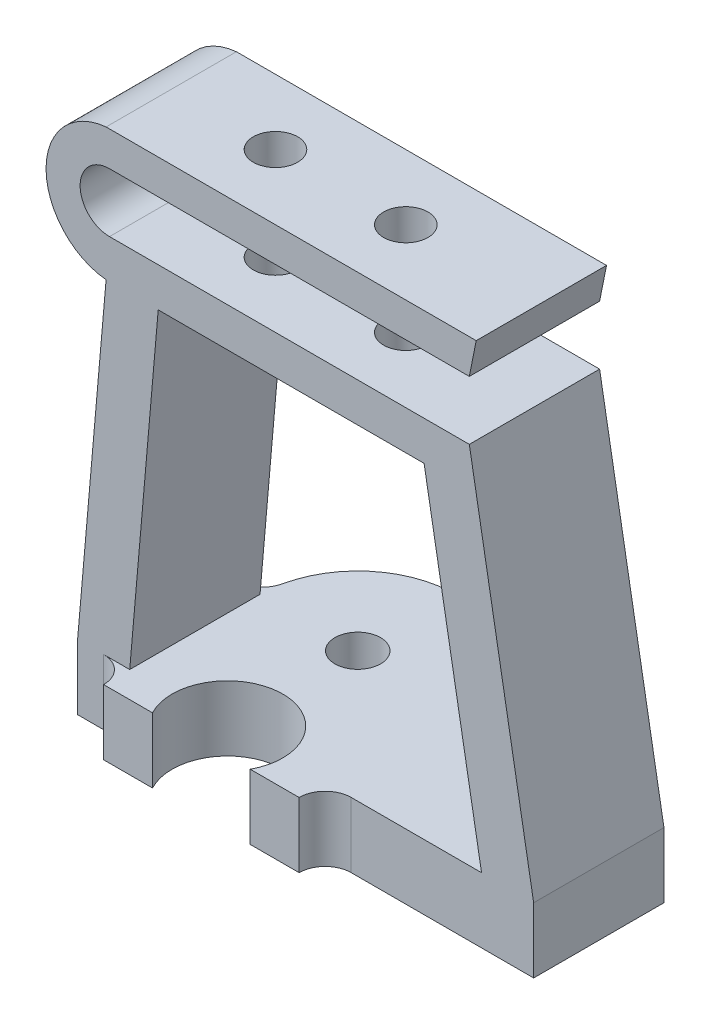
ISO-10303-21;
HEADER;
FILE_DESCRIPTION(('STEP AP214'),'2;1');
FILE_NAME('part.step','',(''),(''),'','','');
FILE_SCHEMA(('AUTOMOTIVE_DESIGN { 1 0 10303 214 1 1 1 1 }'));
ENDSEC;
DATA;
#1=APPLICATION_CONTEXT('core data for automotive mechanical design processes');
#2=APPLICATION_PROTOCOL_DEFINITION('international standard','automotive_design',2000,#1);
#3=PRODUCT_CONTEXT('',#1,'mechanical');
#4=PRODUCT('Part','Part','',(#3));
#5=PRODUCT_RELATED_PRODUCT_CATEGORY('part','',(#4));
#6=PRODUCT_DEFINITION_FORMATION('','',#4);
#7=PRODUCT_DEFINITION_CONTEXT('part definition',#1,'design');
#8=PRODUCT_DEFINITION('design','',#6,#7);
#9=PRODUCT_DEFINITION_SHAPE('','',#8);
#10=(LENGTH_UNIT() NAMED_UNIT(*) SI_UNIT(.MILLI.,.METRE.));
#11=(NAMED_UNIT(*) PLANE_ANGLE_UNIT() SI_UNIT($,.RADIAN.));
#12=(NAMED_UNIT(*) SI_UNIT($,.STERADIAN.) SOLID_ANGLE_UNIT());
#13=UNCERTAINTY_MEASURE_WITH_UNIT(LENGTH_MEASURE(1.E-05),#10,'distance_accuracy_value','');
#14=(GEOMETRIC_REPRESENTATION_CONTEXT(3) GLOBAL_UNCERTAINTY_ASSIGNED_CONTEXT((#13)) GLOBAL_UNIT_ASSIGNED_CONTEXT((#10,
#11,#12)) REPRESENTATION_CONTEXT('',''));
#15=CARTESIAN_POINT('',(0.,0.,0.));
#16=DIRECTION('',(0.,0.,1.));
#17=DIRECTION('',(1.,0.,0.));
#18=AXIS2_PLACEMENT_3D('',#15,#16,#17);
#19=CARTESIAN_POINT('',(0.,5.,10.));
#20=DIRECTION('',(0.,1.,0.));
#21=DIRECTION('',(0.,0.,1.));
#22=AXIS2_PLACEMENT_3D('',#19,#20,#21);
#23=PLANE('',#22);
#24=DIRECTION('',(-1.,0.,0.));
#25=VECTOR('',#24,1.);
#26=CARTESIAN_POINT('',(-16.546680901717,5.,2.));
#27=LINE('',#26,#25);
#28=CARTESIAN_POINT('',(7.5,5.,2.));
#29=VERTEX_POINT('',#28);
#30=CARTESIAN_POINT('',(3.75,5.,2.));
#31=VERTEX_POINT('',#30);
#32=EDGE_CURVE('E216',#29,#31,#27,.T.);
#33=ORIENTED_EDGE('',*,*,#32,.F.);
#34=CARTESIAN_POINT('',(9.5,5.,2.));
#35=DIRECTION('',(0.,1.,0.));
#36=DIRECTION('',(0.,0.,1.));
#37=AXIS2_PLACEMENT_3D('',#34,#35,#36);
#38=CIRCLE('',#37,2.);
#39=CARTESIAN_POINT('',(9.5,5.,0.));
#40=VERTEX_POINT('',#39);
#41=EDGE_CURVE('E229',#29,#40,#38,.F.);
#42=ORIENTED_EDGE('',*,*,#41,.T.);
#43=DIRECTION('',(1.,0.,0.));
#44=VECTOR('',#43,1.);
#45=CARTESIAN_POINT('',(0.,5.,0.));
#46=LINE('',#45,#44);
#47=CARTESIAN_POINT('',(19.5,5.,0.));
#48=VERTEX_POINT('',#47);
#49=EDGE_CURVE('E343',#40,#48,#46,.T.);
#50=ORIENTED_EDGE('',*,*,#49,.T.);
#51=DIRECTION('',(0.,0.,1.));
#52=VECTOR('',#51,1.);
#53=CARTESIAN_POINT('',(19.5,5.,-36.3760762570989));
#54=LINE('',#53,#52);
#55=CARTESIAN_POINT('',(19.5,5.,-10.));
#56=VERTEX_POINT('',#55);
#57=EDGE_CURVE('E397',#56,#48,#54,.T.);
#58=ORIENTED_EDGE('',*,*,#57,.F.);
#59=DIRECTION('',(-1.,0.,0.));
#60=VECTOR('',#59,1.);
#61=CARTESIAN_POINT('',(23.5,5.,-10.));
#62=LINE('',#61,#60);
#63=CARTESIAN_POINT('',(9.28708781050335,5.,-10.));
#64=VERTEX_POINT('',#63);
#65=EDGE_CURVE('E453',#56,#64,#62,.T.);
#66=ORIENTED_EDGE('',*,*,#65,.T.);
#67=CARTESIAN_POINT('',(9.28708781050335,5.,-12.));
#68=DIRECTION('',(0.,1.,0.));
#69=DIRECTION('',(0.,0.,1.));
#70=AXIS2_PLACEMENT_3D('',#67,#68,#69);
#71=CIRCLE('',#70,2.);
#72=CARTESIAN_POINT('',(7.33191142934475,5.,-11.5789473684211));
#73=VERTEX_POINT('',#72);
#74=EDGE_CURVE('E517',#64,#73,#71,.F.);
#75=ORIENTED_EDGE('',*,*,#74,.T.);
#76=CARTESIAN_POINT('',(0.,5.,-10.));
#77=DIRECTION('',(0.,1.,0.));
#78=DIRECTION('',(0.,0.,1.));
#79=AXIS2_PLACEMENT_3D('',#76,#77,#78);
#80=CIRCLE('',#79,7.5);
#81=CARTESIAN_POINT('',(-7.33191142934475,5.,-11.5789473684211));
#82=VERTEX_POINT('',#81);
#83=EDGE_CURVE('E476',#73,#82,#80,.T.);
#84=ORIENTED_EDGE('',*,*,#83,.T.);
#85=CARTESIAN_POINT('',(-9.28708781050335,5.,-12.));
#86=DIRECTION('',(0.,1.,0.));
#87=DIRECTION('',(0.,0.,1.));
#88=AXIS2_PLACEMENT_3D('',#85,#86,#87);
#89=CIRCLE('',#88,2.);
#90=CARTESIAN_POINT('',(-9.28708781050335,5.,-10.));
#91=VERTEX_POINT('',#90);
#92=EDGE_CURVE('E245',#82,#91,#89,.F.);
#93=ORIENTED_EDGE('',*,*,#92,.T.);
#94=DIRECTION('',(-1.,0.,0.));
#95=VECTOR('',#94,1.);
#96=CARTESIAN_POINT('',(23.5,5.,-10.));
#97=LINE('',#96,#95);
#98=CARTESIAN_POINT('',(-7.5,5.,-10.));
#99=VERTEX_POINT('',#98);
#100=EDGE_CURVE('E62',#99,#91,#97,.T.);
#101=ORIENTED_EDGE('',*,*,#100,.F.);
#102=DIRECTION('',(0.,0.,1.));
#103=VECTOR('',#102,1.);
#104=CARTESIAN_POINT('',(-7.5,5.,-36.3760762570989));
#105=LINE('',#104,#103);
#106=CARTESIAN_POINT('',(-7.5,5.,0.));
#107=VERTEX_POINT('',#106);
#108=EDGE_CURVE('E419',#99,#107,#105,.T.);
#109=ORIENTED_EDGE('',*,*,#108,.T.);
#110=DIRECTION('',(1.,0.,0.));
#111=VECTOR('',#110,1.);
#112=CARTESIAN_POINT('',(0.,5.,0.));
#113=LINE('',#112,#111);
#114=CARTESIAN_POINT('',(-9.5,5.,0.));
#115=VERTEX_POINT('',#114);
#116=EDGE_CURVE('E503',#115,#107,#113,.T.);
#117=ORIENTED_EDGE('',*,*,#116,.F.);
#118=CARTESIAN_POINT('',(-9.5,5.,2.));
#119=DIRECTION('',(0.,1.,0.));
#120=DIRECTION('',(0.,0.,1.));
#121=AXIS2_PLACEMENT_3D('',#118,#119,#120);
#122=CIRCLE('',#121,2.);
#123=CARTESIAN_POINT('',(-7.5,5.,2.));
#124=VERTEX_POINT('',#123);
#125=EDGE_CURVE('E54',#115,#124,#122,.F.);
#126=ORIENTED_EDGE('',*,*,#125,.T.);
#127=CARTESIAN_POINT('',(-3.75,5.,2.));
#128=VERTEX_POINT('',#127);
#129=EDGE_CURVE('E70',#128,#124,#27,.T.);
#130=ORIENTED_EDGE('',*,*,#129,.F.);
#131=CARTESIAN_POINT('',(0.,5.,0.));
#132=DIRECTION('',(0.,1.,0.));
#133=DIRECTION('',(0.,0.,1.));
#134=AXIS2_PLACEMENT_3D('',#131,#132,#133);
#135=CIRCLE('',#134,4.25);
#136=EDGE_CURVE('E232',#31,#128,#135,.T.);
#137=ORIENTED_EDGE('',*,*,#136,.F.);
#138=EDGE_LOOP('',(#33,#42,#50,#58,#66,#75,#84,#93,#101,#109,#117,#126,#130,#137));
#139=FACE_BOUND('',#138,.T.);
#140=CARTESIAN_POINT('',(0.,5.,-10.));
#141=DIRECTION('',(0.,1.,0.));
#142=DIRECTION('',(0.,0.,1.));
#143=AXIS2_PLACEMENT_3D('',#140,#141,#142);
#144=CIRCLE('',#143,1.75);
#145=CARTESIAN_POINT('',(0.,5.,-8.25));
#146=VERTEX_POINT('',#145);
#147=EDGE_CURVE('E462',#146,#146,#144,.T.);
#148=ORIENTED_EDGE('',*,*,#147,.F.);
#149=EDGE_LOOP('',(#148));
#150=FACE_BOUND('',#149,.T.);
#151=ADVANCED_FACE('F44',(#139,#150),#23,.T.);
#152=CARTESIAN_POINT('',(23.5,0.,0.));
#153=DIRECTION('',(1.,0.,0.));
#154=DIRECTION('',(0.,0.,-1.));
#155=AXIS2_PLACEMENT_3D('',#152,#153,#154);
#156=PLANE('',#155);
#157=DIRECTION('',(0.,0.,1.));
#158=VECTOR('',#157,1.);
#159=CARTESIAN_POINT('',(23.5,5.,10.));
#160=LINE('',#159,#158);
#161=CARTESIAN_POINT('',(23.5,5.,-10.));
#162=VERTEX_POINT('',#161);
#163=CARTESIAN_POINT('',(23.5,5.,0.));
#164=VERTEX_POINT('',#163);
#165=EDGE_CURVE('E449',#162,#164,#160,.T.);
#166=ORIENTED_EDGE('',*,*,#165,.T.);
#167=DIRECTION('',(0.,-1.,0.));
#168=VECTOR('',#167,1.);
#169=CARTESIAN_POINT('',(23.5,0.,0.));
#170=LINE('',#169,#168);
#171=CARTESIAN_POINT('',(23.5,0.,0.));
#172=VERTEX_POINT('',#171);
#173=EDGE_CURVE('E327',#164,#172,#170,.T.);
#174=ORIENTED_EDGE('',*,*,#173,.T.);
#175=DIRECTION('',(0.,0.,-1.));
#176=VECTOR('',#175,1.);
#177=CARTESIAN_POINT('',(23.5,0.,10.));
#178=LINE('',#177,#176);
#179=CARTESIAN_POINT('',(23.5,0.,-10.));
#180=VERTEX_POINT('',#179);
#181=EDGE_CURVE('E442',#172,#180,#178,.T.);
#182=ORIENTED_EDGE('',*,*,#181,.T.);
#183=DIRECTION('',(0.,1.,0.));
#184=VECTOR('',#183,1.);
#185=CARTESIAN_POINT('',(23.5,5.,-10.));
#186=LINE('',#185,#184);
#187=EDGE_CURVE('E445',#180,#162,#186,.T.);
#188=ORIENTED_EDGE('',*,*,#187,.T.);
#189=EDGE_LOOP('',(#166,#174,#182,#188));
#190=FACE_BOUND('',#189,.T.);
#191=ADVANCED_FACE('F550',(#190),#156,.T.);
#192=CARTESIAN_POINT('',(-11.5,0.,0.));
#193=DIRECTION('',(1.,0.,0.));
#194=DIRECTION('',(0.,0.,-1.));
#195=AXIS2_PLACEMENT_3D('',#192,#193,#194);
#196=PLANE('',#195);
#197=DIRECTION('',(0.,-1.,0.));
#198=VECTOR('',#197,1.);
#199=CARTESIAN_POINT('',(-11.5,0.,0.));
#200=LINE('',#199,#198);
#201=CARTESIAN_POINT('',(-11.5,5.,0.));
#202=VERTEX_POINT('',#201);
#203=CARTESIAN_POINT('',(-11.5,0.,0.));
#204=VERTEX_POINT('',#203);
#205=EDGE_CURVE('E324',#202,#204,#200,.T.);
#206=ORIENTED_EDGE('',*,*,#205,.F.);
#207=DIRECTION('',(0.,0.,1.));
#208=VECTOR('',#207,1.);
#209=CARTESIAN_POINT('',(-11.5,5.,10.));
#210=LINE('',#209,#208);
#211=CARTESIAN_POINT('',(-11.5,5.,-10.));
#212=VERTEX_POINT('',#211);
#213=EDGE_CURVE('E418',#212,#202,#210,.T.);
#214=ORIENTED_EDGE('',*,*,#213,.F.);
#215=DIRECTION('',(0.,1.,0.));
#216=VECTOR('',#215,1.);
#217=CARTESIAN_POINT('',(-11.5,5.,-10.));
#218=LINE('',#217,#216);
#219=CARTESIAN_POINT('',(-11.5,0.,-10.));
#220=VERTEX_POINT('',#219);
#221=EDGE_CURVE('E434',#220,#212,#218,.T.);
#222=ORIENTED_EDGE('',*,*,#221,.F.);
#223=DIRECTION('',(0.,0.,-1.));
#224=VECTOR('',#223,1.);
#225=CARTESIAN_POINT('',(-11.5,0.,10.));
#226=LINE('',#225,#224);
#227=EDGE_CURVE('E431',#204,#220,#226,.T.);
#228=ORIENTED_EDGE('',*,*,#227,.F.);
#229=EDGE_LOOP('',(#206,#214,#222,#228));
#230=FACE_BOUND('',#229,.T.);
#231=ADVANCED_FACE('F590',(#230),#196,.F.);
#232=CARTESIAN_POINT('',(-7.87714951796309,0.689161283720437,-36.3760762570989));
#233=DIRECTION('',(0.996194698091746,-0.0871557427476543,0.));
#234=DIRECTION('',(0.0871557427476543,0.996194698091746,0.));
#235=AXIS2_PLACEMENT_3D('',#232,#233,#234);
#236=PLANE('',#235);
#237=DIRECTION('',(0.,0.,1.));
#238=VECTOR('',#237,1.);
#239=CARTESIAN_POINT('',(-5.312783411852,30.,-36.3760762570989));
#240=LINE('',#239,#238);
#241=CARTESIAN_POINT('',(-5.312783411852,30.,-10.));
#242=VERTEX_POINT('',#241);
#243=CARTESIAN_POINT('',(-5.312783411852,30.,0.));
#244=VERTEX_POINT('',#243);
#245=EDGE_CURVE('E413',#242,#244,#240,.T.);
#246=ORIENTED_EDGE('',*,*,#245,.T.);
#247=DIRECTION('',(-0.0871557427476543,-0.996194698091746,0.));
#248=VECTOR('',#247,1.);
#249=CARTESIAN_POINT('',(-7.87714951796309,0.689161283720437,0.));
#250=LINE('',#249,#248);
#251=EDGE_CURVE('E339',#244,#107,#250,.T.);
#252=ORIENTED_EDGE('',*,*,#251,.T.);
#253=ORIENTED_EDGE('',*,*,#108,.F.);
#254=DIRECTION('',(0.0871557427476543,0.996194698091746,0.));
#255=VECTOR('',#254,1.);
#256=CARTESIAN_POINT('',(-7.87714951796309,0.689161283720437,-10.));
#257=LINE('',#256,#255);
#258=EDGE_CURVE('E409',#99,#242,#257,.T.);
#259=ORIENTED_EDGE('',*,*,#258,.T.);
#260=EDGE_LOOP('',(#246,#252,#253,#259));
#261=FACE_BOUND('',#260,.T.);
#262=ADVANCED_FACE('F561',(#261),#236,.T.);
#263=CARTESIAN_POINT('',(-11.8467650239875,1.03645763905428,-36.3760762570989));
#264=DIRECTION('',(0.996194698091746,-0.0871557427476543,0.));
#265=DIRECTION('',(0.0871557427476543,0.996194698091746,0.));
#266=AXIS2_PLACEMENT_3D('',#263,#264,#265);
#267=PLANE('',#266);
#268=DIRECTION('',(-0.0871557427476543,-0.996194698091746,0.));
#269=VECTOR('',#268,1.);
#270=CARTESIAN_POINT('',(-11.8467650239875,1.03645763905428,0.));
#271=LINE('',#270,#269);
#272=CARTESIAN_POINT('',(-9.312783411852,30.,0.));
#273=VERTEX_POINT('',#272);
#274=EDGE_CURVE('E321',#273,#202,#271,.T.);
#275=ORIENTED_EDGE('',*,*,#274,.F.);
#276=DIRECTION('',(0.,0.,1.));
#277=VECTOR('',#276,1.);
#278=CARTESIAN_POINT('',(-9.312783411852,30.,-36.3760762570989));
#279=LINE('',#278,#277);
#280=CARTESIAN_POINT('',(-9.312783411852,30.,-10.));
#281=VERTEX_POINT('',#280);
#282=EDGE_CURVE('E402',#281,#273,#279,.T.);
#283=ORIENTED_EDGE('',*,*,#282,.F.);
#284=DIRECTION('',(0.0871557427476543,0.996194698091746,0.));
#285=VECTOR('',#284,1.);
#286=CARTESIAN_POINT('',(-11.8467650239875,1.03645763905428,-10.));
#287=LINE('',#286,#285);
#288=EDGE_CURVE('E414',#212,#281,#287,.T.);
#289=ORIENTED_EDGE('',*,*,#288,.F.);
#290=ORIENTED_EDGE('',*,*,#213,.T.);
#291=EDGE_LOOP('',(#275,#283,#289,#290));
#292=FACE_BOUND('',#291,.T.);
#293=ADVANCED_FACE('F646',(#292),#267,.F.);
#294=CARTESIAN_POINT('',(23.6464386525486,4.16950513211192,-36.3760762570989));
#295=DIRECTION('',(0.984807753012207,0.173648177666934,0.));
#296=DIRECTION('',(-0.173648177666934,0.984807753012208,0.));
#297=AXIS2_PLACEMENT_3D('',#294,#295,#296);
#298=PLANE('',#297);
#299=DIRECTION('',(0.,0.,1.));
#300=VECTOR('',#299,1.);
#301=CARTESIAN_POINT('',(18.5628445401629,33.,-44.5402146790618));
#302=LINE('',#301,#300);
#303=CARTESIAN_POINT('',(18.5628445401629,33.,-10.));
#304=VERTEX_POINT('',#303);
#305=CARTESIAN_POINT('',(18.5628445401629,33.,0.));
#306=VERTEX_POINT('',#305);
#307=EDGE_CURVE('E346',#304,#306,#302,.T.);
#308=ORIENTED_EDGE('',*,*,#307,.T.);
#309=DIRECTION('',(0.173648177666934,-0.984807753012208,0.));
#310=VECTOR('',#309,1.);
#311=CARTESIAN_POINT('',(23.6464386525486,4.16950513211192,0.));
#312=LINE('',#311,#310);
#313=EDGE_CURVE('E317',#306,#164,#312,.T.);
#314=ORIENTED_EDGE('',*,*,#313,.T.);
#315=ORIENTED_EDGE('',*,*,#165,.F.);
#316=DIRECTION('',(-0.173648177666934,0.984807753012208,0.));
#317=VECTOR('',#316,1.);
#318=CARTESIAN_POINT('',(23.6464386525486,4.16950513211192,-10.));
#319=LINE('',#318,#317);
#320=EDGE_CURVE('E394',#162,#304,#319,.T.);
#321=ORIENTED_EDGE('',*,*,#320,.T.);
#322=EDGE_LOOP('',(#308,#314,#315,#321));
#323=FACE_BOUND('',#322,.T.);
#324=ADVANCED_FACE('F643',(#323),#298,.T.);
#325=CARTESIAN_POINT('',(19.7670534109768,3.48546484546057,-36.3760762570989));
#326=DIRECTION('',(0.984807753012207,0.173648177666934,0.));
#327=DIRECTION('',(-0.173648177666934,0.984807753012208,0.));
#328=AXIS2_PLACEMENT_3D('',#325,#326,#327);
#329=PLANE('',#328);
#330=DIRECTION('',(0.173648177666934,-0.984807753012208,0.));
#331=VECTOR('',#330,1.);
#332=CARTESIAN_POINT('',(19.7670534109768,3.48546484546057,0.));
#333=LINE('',#332,#331);
#334=CARTESIAN_POINT('',(15.0918254822883,30.,0.));
#335=VERTEX_POINT('',#334);
#336=EDGE_CURVE('E335',#335,#48,#333,.T.);
#337=ORIENTED_EDGE('',*,*,#336,.F.);
#338=DIRECTION('',(0.,0.,1.));
#339=VECTOR('',#338,1.);
#340=CARTESIAN_POINT('',(15.0918254822883,30.,-36.3760762570989));
#341=LINE('',#340,#339);
#342=CARTESIAN_POINT('',(15.0918254822883,30.,-10.));
#343=VERTEX_POINT('',#342);
#344=EDGE_CURVE('E393',#343,#335,#341,.T.);
#345=ORIENTED_EDGE('',*,*,#344,.F.);
#346=DIRECTION('',(-0.173648177666934,0.984807753012208,0.));
#347=VECTOR('',#346,1.);
#348=CARTESIAN_POINT('',(19.7670534109768,3.48546484546057,-10.));
#349=LINE('',#348,#347);
#350=EDGE_CURVE('E398',#56,#343,#349,.T.);
#351=ORIENTED_EDGE('',*,*,#350,.F.);
#352=ORIENTED_EDGE('',*,*,#57,.T.);
#353=EDGE_LOOP('',(#337,#345,#351,#352));
#354=FACE_BOUND('',#353,.T.);
#355=ADVANCED_FACE('F618',(#354),#329,.F.);
#356=CARTESIAN_POINT('',(19.0918254822883,30.,-44.5402146790618));
#357=DIRECTION('',(0.,-1.,0.));
#358=DIRECTION('',(0.,0.,-1.));
#359=AXIS2_PLACEMENT_3D('',#356,#357,#358);
#360=PLANE('',#359);
#361=CARTESIAN_POINT('',(-1.312783411852,30.,-5.));
#362=DIRECTION('',(0.,-1.,0.));
#363=DIRECTION('',(0.,0.,-1.));
#364=AXIS2_PLACEMENT_3D('',#361,#362,#363);
#365=CIRCLE('',#364,1.7);
#366=CARTESIAN_POINT('',(-1.312783411852,30.,-6.7));
#367=VERTEX_POINT('',#366);
#368=EDGE_CURVE('E252',#367,#367,#365,.F.);
#369=ORIENTED_EDGE('',*,*,#368,.T.);
#370=EDGE_LOOP('',(#369));
#371=FACE_BOUND('',#370,.T.);
#372=CARTESIAN_POINT('',(8.687216588148,30.,-5.));
#373=DIRECTION('',(0.,-1.,0.));
#374=DIRECTION('',(0.,0.,-1.));
#375=AXIS2_PLACEMENT_3D('',#372,#373,#374);
#376=CIRCLE('',#375,1.7);
#377=CARTESIAN_POINT('',(8.687216588148,30.,-6.7));
#378=VERTEX_POINT('',#377);
#379=EDGE_CURVE('E269',#378,#378,#376,.F.);
#380=ORIENTED_EDGE('',*,*,#379,.T.);
#381=EDGE_LOOP('',(#380));
#382=FACE_BOUND('',#381,.T.);
#383=ORIENTED_EDGE('',*,*,#344,.T.);
#384=DIRECTION('',(-1.,0.,0.));
#385=VECTOR('',#384,1.);
#386=CARTESIAN_POINT('',(19.0918254822883,30.,0.));
#387=LINE('',#386,#385);
#388=EDGE_CURVE('E331',#335,#244,#387,.T.);
#389=ORIENTED_EDGE('',*,*,#388,.T.);
#390=ORIENTED_EDGE('',*,*,#245,.F.);
#391=DIRECTION('',(-1.,0.,0.));
#392=VECTOR('',#391,1.);
#393=CARTESIAN_POINT('',(19.0918254822883,30.,-10.));
#394=LINE('',#393,#392);
#395=EDGE_CURVE('E363',#343,#242,#394,.T.);
#396=ORIENTED_EDGE('',*,*,#395,.F.);
#397=EDGE_LOOP('',(#383,#389,#390,#396));
#398=FACE_BOUND('',#397,.T.);
#399=ADVANCED_FACE('F559',(#371,#382,#398),#360,.T.);
#400=CARTESIAN_POINT('',(-8.81825785104488,35.0787797921584,-44.5402146790618));
#401=DIRECTION('',(0.,0.,1.));
#402=DIRECTION('',(1.,0.,0.));
#403=AXIS2_PLACEMENT_3D('',#400,#401,#402);
#404=CYLINDRICAL_SURFACE('',#403,5.10279920313629);
#405=ORIENTED_EDGE('',*,*,#282,.T.);
#406=CARTESIAN_POINT('',(-8.81825785104488,35.0787797921584,0.));
#407=DIRECTION('',(0.,0.,1.));
#408=DIRECTION('',(1.,0.,0.));
#409=AXIS2_PLACEMENT_3D('',#406,#407,#408);
#410=CIRCLE('',#409,5.10279920313629);
#411=CARTESIAN_POINT('',(-9.312783411852,40.1575595843169,0.));
#412=VERTEX_POINT('',#411);
#413=EDGE_CURVE('E313',#273,#412,#410,.F.);
#414=ORIENTED_EDGE('',*,*,#413,.T.);
#415=DIRECTION('',(0.,0.,1.));
#416=VECTOR('',#415,1.);
#417=CARTESIAN_POINT('',(-9.312783411852,40.1575595843169,-44.5402146790618));
#418=LINE('',#417,#416);
#419=CARTESIAN_POINT('',(-9.312783411852,40.1575595843169,-10.));
#420=VERTEX_POINT('',#419);
#421=EDGE_CURVE('E351',#420,#412,#418,.T.);
#422=ORIENTED_EDGE('',*,*,#421,.F.);
#423=CARTESIAN_POINT('',(-8.81825785104488,35.0787797921584,-10.));
#424=DIRECTION('',(0.,0.,1.));
#425=DIRECTION('',(1.,0.,0.));
#426=AXIS2_PLACEMENT_3D('',#423,#424,#425);
#427=CIRCLE('',#426,5.10279920313629);
#428=EDGE_CURVE('E360',#281,#420,#427,.F.);
#429=ORIENTED_EDGE('',*,*,#428,.F.);
#430=EDGE_LOOP('',(#405,#414,#422,#429));
#431=FACE_BOUND('',#430,.T.);
#432=ADVANCED_FACE('F617',(#431),#404,.T.);
#433=CARTESIAN_POINT('',(-9.312783411852,40.1575595843169,-44.5402146790618));
#434=DIRECTION('',(0.,1.,0.));
#435=DIRECTION('',(0.,0.,1.));
#436=AXIS2_PLACEMENT_3D('',#433,#434,#435);
#437=PLANE('',#436);
#438=CARTESIAN_POINT('',(-1.312783411852,40.1575595843169,-5.));
#439=DIRECTION('',(0.,1.,0.));
#440=DIRECTION('',(0.,0.,1.));
#441=AXIS2_PLACEMENT_3D('',#438,#439,#440);
#442=CIRCLE('',#441,1.7);
#443=CARTESIAN_POINT('',(-1.312783411852,40.1575595843169,-3.3));
#444=VERTEX_POINT('',#443);
#445=EDGE_CURVE('E260',#444,#444,#442,.T.);
#446=ORIENTED_EDGE('',*,*,#445,.F.);
#447=EDGE_LOOP('',(#446));
#448=FACE_BOUND('',#447,.T.);
#449=CARTESIAN_POINT('',(8.687216588148,40.1575595843169,-5.));
#450=DIRECTION('',(0.,1.,0.));
#451=DIRECTION('',(0.,0.,1.));
#452=AXIS2_PLACEMENT_3D('',#449,#450,#451);
#453=CIRCLE('',#452,1.7);
#454=CARTESIAN_POINT('',(8.687216588148,40.1575595843169,-3.3));
#455=VERTEX_POINT('',#454);
#456=EDGE_CURVE('E266',#455,#455,#453,.T.);
#457=ORIENTED_EDGE('',*,*,#456,.F.);
#458=EDGE_LOOP('',(#457));
#459=FACE_BOUND('',#458,.T.);
#460=ORIENTED_EDGE('',*,*,#421,.T.);
#461=DIRECTION('',(1.,0.,0.));
#462=VECTOR('',#461,1.);
#463=CARTESIAN_POINT('',(-9.312783411852,40.1575595843169,0.));
#464=LINE('',#463,#462);
#465=CARTESIAN_POINT('',(19.0918254822883,40.1575595843169,0.));
#466=VERTEX_POINT('',#465);
#467=EDGE_CURVE('E309',#412,#466,#464,.T.);
#468=ORIENTED_EDGE('',*,*,#467,.T.);
#469=DIRECTION('',(0.,0.,1.));
#470=VECTOR('',#469,1.);
#471=CARTESIAN_POINT('',(19.0918254822883,40.1575595843169,-44.5402146790618));
#472=LINE('',#471,#470);
#473=CARTESIAN_POINT('',(19.0918254822883,40.1575595843169,-10.));
#474=VERTEX_POINT('',#473);
#475=EDGE_CURVE('E371',#474,#466,#472,.T.);
#476=ORIENTED_EDGE('',*,*,#475,.F.);
#477=DIRECTION('',(1.,0.,0.));
#478=VECTOR('',#477,1.);
#479=CARTESIAN_POINT('',(-9.312783411852,40.1575595843169,-10.));
#480=LINE('',#479,#478);
#481=EDGE_CURVE('E357',#420,#474,#480,.T.);
#482=ORIENTED_EDGE('',*,*,#481,.F.);
#483=EDGE_LOOP('',(#460,#468,#476,#482));
#484=FACE_BOUND('',#483,.T.);
#485=ADVANCED_FACE('F621',(#448,#459,#484),#437,.T.);
#486=CARTESIAN_POINT('',(19.0918254822883,40.1575595843169,-44.5402146790618));
#487=DIRECTION('',(0.980569420791083,-0.196172401242986,0.));
#488=DIRECTION('',(0.196172401242986,0.980569420791083,0.));
#489=AXIS2_PLACEMENT_3D('',#486,#487,#488);
#490=PLANE('',#489);
#491=ORIENTED_EDGE('',*,*,#475,.T.);
#492=DIRECTION('',(-0.196172401242986,-0.980569420791083,0.));
#493=VECTOR('',#492,1.);
#494=CARTESIAN_POINT('',(19.0918254822883,40.1575595843169,0.));
#495=LINE('',#494,#493);
#496=CARTESIAN_POINT('',(18.5628445401629,37.5134438333609,0.));
#497=VERTEX_POINT('',#496);
#498=EDGE_CURVE('E305',#466,#497,#495,.T.);
#499=ORIENTED_EDGE('',*,*,#498,.T.);
#500=DIRECTION('',(0.,0.,1.));
#501=VECTOR('',#500,1.);
#502=CARTESIAN_POINT('',(18.5628445401629,37.5134438333609,-44.5402146790618));
#503=LINE('',#502,#501);
#504=CARTESIAN_POINT('',(18.5628445401629,37.5134438333609,-10.));
#505=VERTEX_POINT('',#504);
#506=EDGE_CURVE('E375',#505,#497,#503,.T.);
#507=ORIENTED_EDGE('',*,*,#506,.F.);
#508=DIRECTION('',(-0.196172401242986,-0.980569420791083,0.));
#509=VECTOR('',#508,1.);
#510=CARTESIAN_POINT('',(19.0918254822883,40.1575595843169,-10.));
#511=LINE('',#510,#509);
#512=EDGE_CURVE('E354',#474,#505,#511,.T.);
#513=ORIENTED_EDGE('',*,*,#512,.F.);
#514=EDGE_LOOP('',(#491,#499,#507,#513));
#515=FACE_BOUND('',#514,.T.);
#516=ADVANCED_FACE('F625',(#515),#490,.T.);
#517=CARTESIAN_POINT('',(-9.05031742127424,37.5134438333609,-44.5402146790618));
#518=DIRECTION('',(0.,-1.,0.));
#519=DIRECTION('',(1.,0.,0.));
#520=AXIS2_PLACEMENT_3D('',#517,#518,#519);
#521=PLANE('',#520);
#522=CARTESIAN_POINT('',(-1.312783411852,37.5134438333609,-5.));
#523=DIRECTION('',(0.,-1.,0.));
#524=DIRECTION('',(1.,0.,0.));
#525=AXIS2_PLACEMENT_3D('',#522,#523,#524);
#526=CIRCLE('',#525,1.7);
#527=CARTESIAN_POINT('',(0.387216588148002,37.5134438333609,-5.));
#528=VERTEX_POINT('',#527);
#529=EDGE_CURVE('E276',#528,#528,#526,.T.);
#530=ORIENTED_EDGE('',*,*,#529,.F.);
#531=EDGE_LOOP('',(#530));
#532=FACE_BOUND('',#531,.T.);
#533=CARTESIAN_POINT('',(8.687216588148,37.5134438333609,-5.));
#534=DIRECTION('',(0.,-1.,0.));
#535=DIRECTION('',(1.,0.,0.));
#536=AXIS2_PLACEMENT_3D('',#533,#534,#535);
#537=CIRCLE('',#536,1.7);
#538=CARTESIAN_POINT('',(10.387216588148,37.5134438333609,-5.));
#539=VERTEX_POINT('',#538);
#540=EDGE_CURVE('E251',#539,#539,#537,.T.);
#541=ORIENTED_EDGE('',*,*,#540,.F.);
#542=EDGE_LOOP('',(#541));
#543=FACE_BOUND('',#542,.T.);
#544=ORIENTED_EDGE('',*,*,#506,.T.);
#545=DIRECTION('',(-1.,0.,0.));
#546=VECTOR('',#545,1.);
#547=CARTESIAN_POINT('',(-9.05031742127424,37.5134438333609,0.));
#548=LINE('',#547,#546);
#549=CARTESIAN_POINT('',(-9.05031742127424,37.5134438333609,0.));
#550=VERTEX_POINT('',#549);
#551=EDGE_CURVE('E301',#497,#550,#548,.T.);
#552=ORIENTED_EDGE('',*,*,#551,.T.);
#553=DIRECTION('',(0.,0.,1.));
#554=VECTOR('',#553,1.);
#555=CARTESIAN_POINT('',(-9.05031742127424,37.5134438333609,-44.5402146790618));
#556=LINE('',#555,#554);
#557=CARTESIAN_POINT('',(-9.05031742127424,37.5134438333609,-10.));
#558=VERTEX_POINT('',#557);
#559=EDGE_CURVE('E379',#558,#550,#556,.T.);
#560=ORIENTED_EDGE('',*,*,#559,.F.);
#561=DIRECTION('',(-1.,0.,0.));
#562=VECTOR('',#561,1.);
#563=CARTESIAN_POINT('',(-9.05031742127424,37.5134438333609,-10.));
#564=LINE('',#563,#562);
#565=EDGE_CURVE('E350',#505,#558,#564,.T.);
#566=ORIENTED_EDGE('',*,*,#565,.F.);
#567=EDGE_LOOP('',(#544,#552,#560,#566));
#568=FACE_BOUND('',#567,.T.);
#569=ADVANCED_FACE('F629',(#532,#543,#568),#521,.T.);
#570=CARTESIAN_POINT('',(-9.05031742127424,35.2567219166804,-44.5402146790618));
#571=DIRECTION('',(0.,0.,1.));
#572=DIRECTION('',(1.,0.,0.));
#573=AXIS2_PLACEMENT_3D('',#570,#571,#572);
#574=CYLINDRICAL_SURFACE('',#573,2.25672191668044);
#575=ORIENTED_EDGE('',*,*,#559,.T.);
#576=CARTESIAN_POINT('',(-9.05031742127424,35.2567219166804,0.));
#577=DIRECTION('',(0.,0.,1.));
#578=DIRECTION('',(1.,0.,0.));
#579=AXIS2_PLACEMENT_3D('',#576,#577,#578);
#580=CIRCLE('',#579,2.25672191668044);
#581=CARTESIAN_POINT('',(-9.05031742127424,33.,0.));
#582=VERTEX_POINT('',#581);
#583=EDGE_CURVE('E297',#550,#582,#580,.T.);
#584=ORIENTED_EDGE('',*,*,#583,.T.);
#585=DIRECTION('',(0.,0.,1.));
#586=VECTOR('',#585,1.);
#587=CARTESIAN_POINT('',(-9.05031742127424,33.,-44.5402146790618));
#588=LINE('',#587,#586);
#589=CARTESIAN_POINT('',(-9.05031742127424,33.,-10.));
#590=VERTEX_POINT('',#589);
#591=EDGE_CURVE('E383',#590,#582,#588,.T.);
#592=ORIENTED_EDGE('',*,*,#591,.F.);
#593=CARTESIAN_POINT('',(-9.05031742127424,35.2567219166804,-10.));
#594=DIRECTION('',(0.,0.,1.));
#595=DIRECTION('',(1.,0.,0.));
#596=AXIS2_PLACEMENT_3D('',#593,#594,#595);
#597=CIRCLE('',#596,2.25672191668044);
#598=EDGE_CURVE('E347',#558,#590,#597,.T.);
#599=ORIENTED_EDGE('',*,*,#598,.F.);
#600=EDGE_LOOP('',(#575,#584,#592,#599));
#601=FACE_BOUND('',#600,.T.);
#602=ADVANCED_FACE('F633',(#601),#574,.F.);
#603=CARTESIAN_POINT('',(18.5628445401629,33.,-44.5402146790618));
#604=DIRECTION('',(0.,1.,0.));
#605=DIRECTION('',(-1.,0.,0.));
#606=AXIS2_PLACEMENT_3D('',#603,#604,#605);
#607=PLANE('',#606);
#608=CARTESIAN_POINT('',(-1.312783411852,33.,-5.));
#609=DIRECTION('',(0.,1.,0.));
#610=DIRECTION('',(-1.,0.,0.));
#611=AXIS2_PLACEMENT_3D('',#608,#609,#610);
#612=CIRCLE('',#611,1.7);
#613=CARTESIAN_POINT('',(-3.012783411852,33.,-5.));
#614=VERTEX_POINT('',#613);
#615=EDGE_CURVE('E48',#614,#614,#612,.T.);
#616=ORIENTED_EDGE('',*,*,#615,.F.);
#617=EDGE_LOOP('',(#616));
#618=FACE_BOUND('',#617,.T.);
#619=CARTESIAN_POINT('',(8.687216588148,33.,-5.));
#620=DIRECTION('',(0.,1.,0.));
#621=DIRECTION('',(-1.,0.,0.));
#622=AXIS2_PLACEMENT_3D('',#619,#620,#621);
#623=CIRCLE('',#622,1.7);
#624=CARTESIAN_POINT('',(6.987216588148,33.,-5.));
#625=VERTEX_POINT('',#624);
#626=EDGE_CURVE('E248',#625,#625,#623,.T.);
#627=ORIENTED_EDGE('',*,*,#626,.F.);
#628=EDGE_LOOP('',(#627));
#629=FACE_BOUND('',#628,.T.);
#630=ORIENTED_EDGE('',*,*,#591,.T.);
#631=DIRECTION('',(1.,0.,0.));
#632=VECTOR('',#631,1.);
#633=CARTESIAN_POINT('',(18.5628445401629,33.,0.));
#634=LINE('',#633,#632);
#635=EDGE_CURVE('E480',#582,#306,#634,.T.);
#636=ORIENTED_EDGE('',*,*,#635,.T.);
#637=ORIENTED_EDGE('',*,*,#307,.F.);
#638=DIRECTION('',(1.,0.,0.));
#639=VECTOR('',#638,1.);
#640=CARTESIAN_POINT('',(18.5628445401629,33.,-10.));
#641=LINE('',#640,#639);
#642=EDGE_CURVE('E367',#590,#304,#641,.T.);
#643=ORIENTED_EDGE('',*,*,#642,.F.);
#644=EDGE_LOOP('',(#630,#636,#637,#643));
#645=FACE_BOUND('',#644,.T.);
#646=ADVANCED_FACE('F594',(#618,#629,#645),#607,.T.);
#647=CARTESIAN_POINT('',(0.,0.,10.));
#648=DIRECTION('',(0.,1.,0.));
#649=DIRECTION('',(0.,0.,1.));
#650=AXIS2_PLACEMENT_3D('',#647,#648,#649);
#651=PLANE('',#650);
#652=CARTESIAN_POINT('',(9.5,0.,2.));
#653=DIRECTION('',(0.,1.,0.));
#654=DIRECTION('',(0.,0.,1.));
#655=AXIS2_PLACEMENT_3D('',#652,#653,#654);
#656=CIRCLE('',#655,2.);
#657=CARTESIAN_POINT('',(9.5,0.,0.));
#658=VERTEX_POINT('',#657);
#659=CARTESIAN_POINT('',(7.5,0.,2.));
#660=VERTEX_POINT('',#659);
#661=EDGE_CURVE('E240',#658,#660,#656,.T.);
#662=ORIENTED_EDGE('',*,*,#661,.T.);
#663=DIRECTION('',(-1.,0.,0.));
#664=VECTOR('',#663,1.);
#665=CARTESIAN_POINT('',(-16.546680901717,0.,2.));
#666=LINE('',#665,#664);
#667=CARTESIAN_POINT('',(3.75,0.,2.));
#668=VERTEX_POINT('',#667);
#669=EDGE_CURVE('E219',#660,#668,#666,.T.);
#670=ORIENTED_EDGE('',*,*,#669,.T.);
#671=CARTESIAN_POINT('',(0.,0.,0.));
#672=DIRECTION('',(0.,1.,0.));
#673=DIRECTION('',(0.,0.,1.));
#674=AXIS2_PLACEMENT_3D('',#671,#672,#673);
#675=CIRCLE('',#674,4.25);
#676=CARTESIAN_POINT('',(-3.75,0.,2.));
#677=VERTEX_POINT('',#676);
#678=EDGE_CURVE('E466',#668,#677,#675,.T.);
#679=ORIENTED_EDGE('',*,*,#678,.T.);
#680=CARTESIAN_POINT('',(-7.5,0.,2.));
#681=VERTEX_POINT('',#680);
#682=EDGE_CURVE('E234',#677,#681,#666,.T.);
#683=ORIENTED_EDGE('',*,*,#682,.T.);
#684=CARTESIAN_POINT('',(-9.5,0.,2.));
#685=DIRECTION('',(0.,1.,0.));
#686=DIRECTION('',(0.,0.,1.));
#687=AXIS2_PLACEMENT_3D('',#684,#685,#686);
#688=CIRCLE('',#687,2.);
#689=CARTESIAN_POINT('',(-9.5,0.,0.));
#690=VERTEX_POINT('',#689);
#691=EDGE_CURVE('E11',#681,#690,#688,.T.);
#692=ORIENTED_EDGE('',*,*,#691,.T.);
#693=DIRECTION('',(1.,0.,0.));
#694=VECTOR('',#693,1.);
#695=CARTESIAN_POINT('',(-7.5,0.,0.));
#696=LINE('',#695,#694);
#697=EDGE_CURVE('E293',#204,#690,#696,.T.);
#698=ORIENTED_EDGE('',*,*,#697,.F.);
#699=ORIENTED_EDGE('',*,*,#227,.T.);
#700=DIRECTION('',(1.,0.,0.));
#701=VECTOR('',#700,1.);
#702=CARTESIAN_POINT('',(-11.5,0.,-10.));
#703=LINE('',#702,#701);
#704=CARTESIAN_POINT('',(-9.28708781050335,0.,-10.));
#705=VERTEX_POINT('',#704);
#706=EDGE_CURVE('E438',#220,#705,#703,.T.);
#707=ORIENTED_EDGE('',*,*,#706,.T.);
#708=CARTESIAN_POINT('',(-9.28708781050335,0.,-12.));
#709=DIRECTION('',(0.,1.,0.));
#710=DIRECTION('',(0.,0.,1.));
#711=AXIS2_PLACEMENT_3D('',#708,#709,#710);
#712=CIRCLE('',#711,2.);
#713=CARTESIAN_POINT('',(-7.33191142934475,0.,-11.5789473684211));
#714=VERTEX_POINT('',#713);
#715=EDGE_CURVE('E520',#705,#714,#712,.T.);
#716=ORIENTED_EDGE('',*,*,#715,.T.);
#717=CARTESIAN_POINT('',(0.,0.,-10.));
#718=DIRECTION('',(0.,1.,0.));
#719=DIRECTION('',(0.,0.,1.));
#720=AXIS2_PLACEMENT_3D('',#717,#718,#719);
#721=CIRCLE('',#720,7.5);
#722=CARTESIAN_POINT('',(7.33191142934475,0.,-11.5789473684211));
#723=VERTEX_POINT('',#722);
#724=EDGE_CURVE('E472',#723,#714,#721,.T.);
#725=ORIENTED_EDGE('',*,*,#724,.F.);
#726=CARTESIAN_POINT('',(9.28708781050335,0.,-12.));
#727=DIRECTION('',(0.,1.,0.));
#728=DIRECTION('',(0.,0.,1.));
#729=AXIS2_PLACEMENT_3D('',#726,#727,#728);
#730=CIRCLE('',#729,2.);
#731=CARTESIAN_POINT('',(9.28708781050335,0.,-10.));
#732=VERTEX_POINT('',#731);
#733=EDGE_CURVE('E514',#723,#732,#730,.T.);
#734=ORIENTED_EDGE('',*,*,#733,.T.);
#735=DIRECTION('',(-1.,0.,0.));
#736=VECTOR('',#735,1.);
#737=CARTESIAN_POINT('',(23.5,0.,-10.));
#738=LINE('',#737,#736);
#739=EDGE_CURVE('E457',#180,#732,#738,.T.);
#740=ORIENTED_EDGE('',*,*,#739,.F.);
#741=ORIENTED_EDGE('',*,*,#181,.F.);
#742=DIRECTION('',(1.,0.,0.));
#743=VECTOR('',#742,1.);
#744=CARTESIAN_POINT('',(27.2835571565183,0.,0.));
#745=LINE('',#744,#743);
#746=EDGE_CURVE('E290',#658,#172,#745,.T.);
#747=ORIENTED_EDGE('',*,*,#746,.F.);
#748=EDGE_LOOP('',(#662,#670,#679,#683,#692,#698,#699,#707,#716,#725,#734,#740,#741,#747));
#749=FACE_BOUND('',#748,.T.);
#750=CARTESIAN_POINT('',(0.,0.,-10.));
#751=DIRECTION('',(0.,1.,0.));
#752=DIRECTION('',(0.,0.,1.));
#753=AXIS2_PLACEMENT_3D('',#750,#751,#752);
#754=CIRCLE('',#753,1.75);
#755=CARTESIAN_POINT('',(0.,0.,-8.25));
#756=VERTEX_POINT('',#755);
#757=EDGE_CURVE('E461',#756,#756,#754,.T.);
#758=ORIENTED_EDGE('',*,*,#757,.T.);
#759=EDGE_LOOP('',(#758));
#760=FACE_BOUND('',#759,.T.);
#761=ADVANCED_FACE('F535',(#749,#760),#651,.F.);
#762=CARTESIAN_POINT('',(0.,5.,-10.));
#763=DIRECTION('',(0.,-1.,0.));
#764=DIRECTION('',(0.,0.,-1.));
#765=AXIS2_PLACEMENT_3D('',#762,#763,#764);
#766=CYLINDRICAL_SURFACE('',#765,7.5);
#767=ORIENTED_EDGE('',*,*,#83,.F.);
#768=DIRECTION('',(0.,-1.,0.));
#769=VECTOR('',#768,1.);
#770=CARTESIAN_POINT('',(7.33191142934475,5.,-11.5789473684211));
#771=LINE('',#770,#769);
#772=EDGE_CURVE('E490',#73,#723,#771,.T.);
#773=ORIENTED_EDGE('',*,*,#772,.T.);
#774=ORIENTED_EDGE('',*,*,#724,.T.);
#775=DIRECTION('',(0.,-1.,0.));
#776=VECTOR('',#775,1.);
#777=CARTESIAN_POINT('',(-7.33191142934475,5.,-11.5789473684211));
#778=LINE('',#777,#776);
#779=EDGE_CURVE('E487',#714,#82,#778,.F.);
#780=ORIENTED_EDGE('',*,*,#779,.T.);
#781=EDGE_LOOP('',(#767,#773,#774,#780));
#782=FACE_BOUND('',#781,.T.);
#783=ADVANCED_FACE('F538',(#782),#766,.T.);
#784=CARTESIAN_POINT('',(0.,5.,0.));
#785=DIRECTION('',(0.,-1.,0.));
#786=DIRECTION('',(0.,0.,-1.));
#787=AXIS2_PLACEMENT_3D('',#784,#785,#786);
#788=CYLINDRICAL_SURFACE('',#787,4.25);
#789=DIRECTION('',(0.,-1.,0.));
#790=VECTOR('',#789,1.);
#791=CARTESIAN_POINT('',(3.75,5.,2.));
#792=LINE('',#791,#790);
#793=EDGE_CURVE('E287',#31,#668,#792,.T.);
#794=ORIENTED_EDGE('',*,*,#793,.F.);
#795=ORIENTED_EDGE('',*,*,#136,.T.);
#796=DIRECTION('',(0.,-1.,0.));
#797=VECTOR('',#796,1.);
#798=CARTESIAN_POINT('',(-3.75,5.,2.));
#799=LINE('',#798,#797);
#800=EDGE_CURVE('E284',#677,#128,#799,.F.);
#801=ORIENTED_EDGE('',*,*,#800,.F.);
#802=ORIENTED_EDGE('',*,*,#678,.F.);
#803=EDGE_LOOP('',(#794,#795,#801,#802));
#804=FACE_BOUND('',#803,.T.);
#805=ADVANCED_FACE('F572',(#804),#788,.F.);
#806=CARTESIAN_POINT('',(0.,5.,-10.));
#807=DIRECTION('',(0.,-1.,0.));
#808=DIRECTION('',(0.,0.,-1.));
#809=AXIS2_PLACEMENT_3D('',#806,#807,#808);
#810=CYLINDRICAL_SURFACE('',#809,1.75);
#811=ORIENTED_EDGE('',*,*,#147,.T.);
#812=EDGE_LOOP('',(#811));
#813=FACE_BOUND('',#812,.T.);
#814=ORIENTED_EDGE('',*,*,#757,.F.);
#815=EDGE_LOOP('',(#814));
#816=FACE_BOUND('',#815,.T.);
#817=ADVANCED_FACE('F574',(#813,#816),#810,.F.);
#818=CARTESIAN_POINT('',(23.5,5.,-10.));
#819=DIRECTION('',(0.,0.,1.));
#820=DIRECTION('',(1.,0.,0.));
#821=AXIS2_PLACEMENT_3D('',#818,#819,#820);
#822=PLANE('',#821);
#823=ORIENTED_EDGE('',*,*,#739,.T.);
#824=DIRECTION('',(0.,1.,0.));
#825=VECTOR('',#824,1.);
#826=CARTESIAN_POINT('',(9.28708781050335,5.,-10.));
#827=LINE('',#826,#825);
#828=EDGE_CURVE('E500',#732,#64,#827,.T.);
#829=ORIENTED_EDGE('',*,*,#828,.T.);
#830=ORIENTED_EDGE('',*,*,#65,.F.);
#831=ORIENTED_EDGE('',*,*,#350,.T.);
#832=ORIENTED_EDGE('',*,*,#395,.T.);
#833=ORIENTED_EDGE('',*,*,#258,.F.);
#834=ORIENTED_EDGE('',*,*,#100,.T.);
#835=DIRECTION('',(0.,1.,0.));
#836=VECTOR('',#835,1.);
#837=CARTESIAN_POINT('',(-9.28708781050335,0.,-10.));
#838=LINE('',#837,#836);
#839=EDGE_CURVE('E496',#91,#705,#838,.F.);
#840=ORIENTED_EDGE('',*,*,#839,.T.);
#841=ORIENTED_EDGE('',*,*,#706,.F.);
#842=ORIENTED_EDGE('',*,*,#221,.T.);
#843=ORIENTED_EDGE('',*,*,#288,.T.);
#844=ORIENTED_EDGE('',*,*,#428,.T.);
#845=ORIENTED_EDGE('',*,*,#481,.T.);
#846=ORIENTED_EDGE('',*,*,#512,.T.);
#847=ORIENTED_EDGE('',*,*,#565,.T.);
#848=ORIENTED_EDGE('',*,*,#598,.T.);
#849=ORIENTED_EDGE('',*,*,#642,.T.);
#850=ORIENTED_EDGE('',*,*,#320,.F.);
#851=ORIENTED_EDGE('',*,*,#187,.F.);
#852=EDGE_LOOP('',(#823,#829,#830,#831,#832,#833,#834,#840,#841,#842,#843,#844,#845,#846,#847,
#848,#849,#850,#851));
#853=FACE_BOUND('',#852,.T.);
#854=ADVANCED_FACE('F529',(#853),#822,.F.);
#855=CARTESIAN_POINT('',(0.,0.,0.));
#856=DIRECTION('',(0.,0.,1.));
#857=DIRECTION('',(1.,0.,0.));
#858=AXIS2_PLACEMENT_3D('',#855,#856,#857);
#859=PLANE('',#858);
#860=ORIENTED_EDGE('',*,*,#49,.F.);
#861=DIRECTION('',(0.,-1.,0.));
#862=VECTOR('',#861,1.);
#863=CARTESIAN_POINT('',(9.5,0.,0.));
#864=LINE('',#863,#862);
#865=EDGE_CURVE('E225',#40,#658,#864,.T.);
#866=ORIENTED_EDGE('',*,*,#865,.T.);
#867=ORIENTED_EDGE('',*,*,#746,.T.);
#868=ORIENTED_EDGE('',*,*,#173,.F.);
#869=ORIENTED_EDGE('',*,*,#313,.F.);
#870=ORIENTED_EDGE('',*,*,#635,.F.);
#871=ORIENTED_EDGE('',*,*,#583,.F.);
#872=ORIENTED_EDGE('',*,*,#551,.F.);
#873=ORIENTED_EDGE('',*,*,#498,.F.);
#874=ORIENTED_EDGE('',*,*,#467,.F.);
#875=ORIENTED_EDGE('',*,*,#413,.F.);
#876=ORIENTED_EDGE('',*,*,#274,.T.);
#877=ORIENTED_EDGE('',*,*,#205,.T.);
#878=ORIENTED_EDGE('',*,*,#697,.T.);
#879=DIRECTION('',(0.,1.,0.));
#880=VECTOR('',#879,1.);
#881=CARTESIAN_POINT('',(-9.5,0.,0.));
#882=LINE('',#881,#880);
#883=EDGE_CURVE('E506',#690,#115,#882,.T.);
#884=ORIENTED_EDGE('',*,*,#883,.T.);
#885=ORIENTED_EDGE('',*,*,#116,.T.);
#886=ORIENTED_EDGE('',*,*,#251,.F.);
#887=ORIENTED_EDGE('',*,*,#388,.F.);
#888=ORIENTED_EDGE('',*,*,#336,.T.);
#889=EDGE_LOOP('',(#860,#866,#867,#868,#869,#870,#871,#872,#873,#874,#875,#876,#877,#878,#884,
#885,#886,#887,#888));
#890=FACE_BOUND('',#889,.T.);
#891=ADVANCED_FACE('F553',(#890),#859,.T.);
#892=CARTESIAN_POINT('',(9.28708781050335,5.,-12.));
#893=DIRECTION('',(0.,-1.,0.));
#894=DIRECTION('',(0.,0.,-1.));
#895=AXIS2_PLACEMENT_3D('',#892,#893,#894);
#896=CYLINDRICAL_SURFACE('',#895,2.);
#897=ORIENTED_EDGE('',*,*,#74,.F.);
#898=ORIENTED_EDGE('',*,*,#828,.F.);
#899=ORIENTED_EDGE('',*,*,#733,.F.);
#900=ORIENTED_EDGE('',*,*,#772,.F.);
#901=EDGE_LOOP('',(#897,#898,#899,#900));
#902=FACE_BOUND('',#901,.T.);
#903=ADVANCED_FACE('F542',(#902),#896,.F.);
#904=CARTESIAN_POINT('',(-9.28708781050335,5.,-12.));
#905=DIRECTION('',(0.,-1.,0.));
#906=DIRECTION('',(0.,0.,-1.));
#907=AXIS2_PLACEMENT_3D('',#904,#905,#906);
#908=CYLINDRICAL_SURFACE('',#907,2.);
#909=ORIENTED_EDGE('',*,*,#92,.F.);
#910=ORIENTED_EDGE('',*,*,#779,.F.);
#911=ORIENTED_EDGE('',*,*,#715,.F.);
#912=ORIENTED_EDGE('',*,*,#839,.F.);
#913=EDGE_LOOP('',(#909,#910,#911,#912));
#914=FACE_BOUND('',#913,.T.);
#915=ADVANCED_FACE('F532',(#914),#908,.F.);
#916=CARTESIAN_POINT('',(9.5,0.,2.));
#917=DIRECTION('',(0.,-1.,0.));
#918=DIRECTION('',(0.,0.,-1.));
#919=AXIS2_PLACEMENT_3D('',#916,#917,#918);
#920=CYLINDRICAL_SURFACE('',#919,2.);
#921=ORIENTED_EDGE('',*,*,#41,.F.);
#922=DIRECTION('',(0.,-1.,0.));
#923=VECTOR('',#922,1.);
#924=CARTESIAN_POINT('',(7.5,0.,2.));
#925=LINE('',#924,#923);
#926=EDGE_CURVE('E213',#660,#29,#925,.F.);
#927=ORIENTED_EDGE('',*,*,#926,.F.);
#928=ORIENTED_EDGE('',*,*,#661,.F.);
#929=ORIENTED_EDGE('',*,*,#865,.F.);
#930=EDGE_LOOP('',(#921,#927,#928,#929));
#931=FACE_BOUND('',#930,.T.);
#932=ADVANCED_FACE('F237',(#931),#920,.F.);
#933=CARTESIAN_POINT('',(-9.5,0.,2.));
#934=DIRECTION('',(0.,1.,0.));
#935=DIRECTION('',(0.,0.,1.));
#936=AXIS2_PLACEMENT_3D('',#933,#934,#935);
#937=CYLINDRICAL_SURFACE('',#936,2.);
#938=ORIENTED_EDGE('',*,*,#691,.F.);
#939=DIRECTION('',(0.,1.,0.));
#940=VECTOR('',#939,1.);
#941=CARTESIAN_POINT('',(-7.5,5.,2.));
#942=LINE('',#941,#940);
#943=EDGE_CURVE('E224',#124,#681,#942,.F.);
#944=ORIENTED_EDGE('',*,*,#943,.F.);
#945=ORIENTED_EDGE('',*,*,#125,.F.);
#946=ORIENTED_EDGE('',*,*,#883,.F.);
#947=EDGE_LOOP('',(#938,#944,#945,#946));
#948=FACE_BOUND('',#947,.T.);
#949=ADVANCED_FACE('F46',(#948),#937,.F.);
#950=CARTESIAN_POINT('',(-16.546680901717,0.,2.));
#951=DIRECTION('',(0.,0.,-1.));
#952=DIRECTION('',(-1.,0.,0.));
#953=AXIS2_PLACEMENT_3D('',#950,#951,#952);
#954=PLANE('',#953);
#955=ORIENTED_EDGE('',*,*,#800,.T.);
#956=ORIENTED_EDGE('',*,*,#129,.T.);
#957=ORIENTED_EDGE('',*,*,#943,.T.);
#958=ORIENTED_EDGE('',*,*,#682,.F.);
#959=EDGE_LOOP('',(#955,#956,#957,#958));
#960=FACE_BOUND('',#959,.T.);
#961=ADVANCED_FACE('F568',(#960),#954,.F.);
#962=ORIENTED_EDGE('',*,*,#793,.T.);
#963=ORIENTED_EDGE('',*,*,#669,.F.);
#964=ORIENTED_EDGE('',*,*,#926,.T.);
#965=ORIENTED_EDGE('',*,*,#32,.T.);
#966=EDGE_LOOP('',(#962,#963,#964,#965));
#967=FACE_BOUND('',#966,.T.);
#968=ADVANCED_FACE('F215',(#967),#954,.F.);
#969=CARTESIAN_POINT('',(8.687216588148,25.1916738879315,-5.));
#970=DIRECTION('',(0.,1.,0.));
#971=DIRECTION('',(0.,0.,1.));
#972=AXIS2_PLACEMENT_3D('',#969,#970,#971);
#973=CYLINDRICAL_SURFACE('',#972,1.7);
#974=ORIENTED_EDGE('',*,*,#626,.T.);
#975=EDGE_LOOP('',(#974));
#976=FACE_BOUND('',#975,.T.);
#977=ORIENTED_EDGE('',*,*,#379,.F.);
#978=EDGE_LOOP('',(#977));
#979=FACE_BOUND('',#978,.T.);
#980=ADVANCED_FACE('F609',(#976,#979),#973,.F.);
#981=CARTESIAN_POINT('',(-1.312783411852,25.1916738879315,-5.));
#982=DIRECTION('',(0.,1.,0.));
#983=DIRECTION('',(0.,0.,1.));
#984=AXIS2_PLACEMENT_3D('',#981,#982,#983);
#985=CYLINDRICAL_SURFACE('',#984,1.7);
#986=ORIENTED_EDGE('',*,*,#615,.T.);
#987=EDGE_LOOP('',(#986));
#988=FACE_BOUND('',#987,.T.);
#989=ORIENTED_EDGE('',*,*,#368,.F.);
#990=EDGE_LOOP('',(#989));
#991=FACE_BOUND('',#990,.T.);
#992=ADVANCED_FACE('F829',(#988,#991),#985,.F.);
#993=ORIENTED_EDGE('',*,*,#540,.T.);
#994=EDGE_LOOP('',(#993));
#995=FACE_BOUND('',#994,.T.);
#996=ORIENTED_EDGE('',*,*,#456,.T.);
#997=EDGE_LOOP('',(#996));
#998=FACE_BOUND('',#997,.T.);
#999=ADVANCED_FACE('F830',(#995,#998),#973,.F.);
#1000=ORIENTED_EDGE('',*,*,#529,.T.);
#1001=EDGE_LOOP('',(#1000));
#1002=FACE_BOUND('',#1001,.T.);
#1003=ORIENTED_EDGE('',*,*,#445,.T.);
#1004=EDGE_LOOP('',(#1003));
#1005=FACE_BOUND('',#1004,.T.);
#1006=ADVANCED_FACE('F839',(#1002,#1005),#985,.F.);
#1007=CLOSED_SHELL('',(#151,#191,#231,#262,#293,#324,#355,#399,#432,#485,#516,#569,#602,#646,
#761,#783,#805,#817,#854,#891,#903,#915,#932,#949,#961,#968,#980,#992,#999,#1006));
#1008=MANIFOLD_SOLID_BREP('B2',#1007);
#1009=ADVANCED_BREP_SHAPE_REPRESENTATION('',(#18,#1008),#14);
#1010=SHAPE_DEFINITION_REPRESENTATION(#9,#1009);
ENDSEC;
END-ISO-10303-21;
